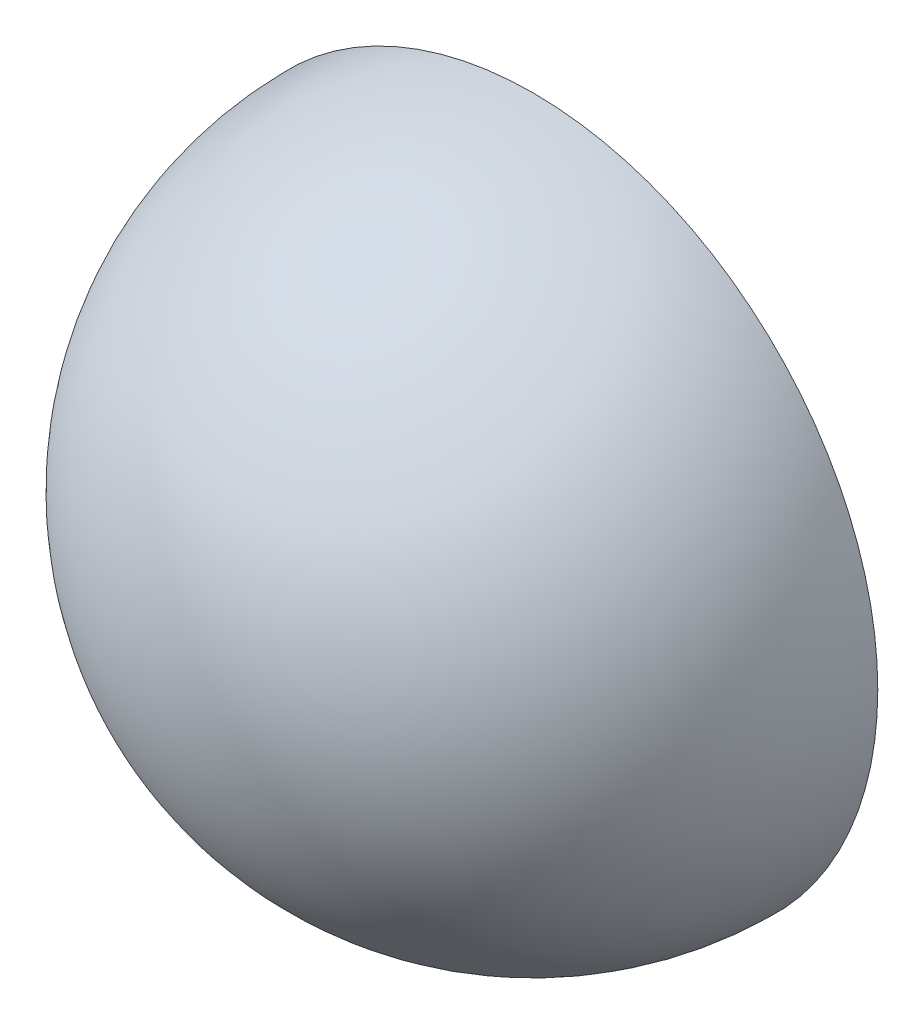
ISO-10303-21;
HEADER;
FILE_DESCRIPTION(('STEP AP214'),'2;1');
FILE_NAME('part.step','',(''),(''),'','','');
FILE_SCHEMA(('AUTOMOTIVE_DESIGN { 1 0 10303 214 1 1 1 1 }'));
ENDSEC;
DATA;
#1=APPLICATION_CONTEXT('core data for automotive mechanical design processes');
#2=APPLICATION_PROTOCOL_DEFINITION('international standard','automotive_design',2000,#1);
#3=PRODUCT_CONTEXT('',#1,'mechanical');
#4=PRODUCT('Part','Part','',(#3));
#5=PRODUCT_RELATED_PRODUCT_CATEGORY('part','',(#4));
#6=PRODUCT_DEFINITION_FORMATION('','',#4);
#7=PRODUCT_DEFINITION_CONTEXT('part definition',#1,'design');
#8=PRODUCT_DEFINITION('design','',#6,#7);
#9=PRODUCT_DEFINITION_SHAPE('','',#8);
#10=(LENGTH_UNIT() NAMED_UNIT(*) SI_UNIT(.MILLI.,.METRE.));
#11=(NAMED_UNIT(*) PLANE_ANGLE_UNIT() SI_UNIT($,.RADIAN.));
#12=(NAMED_UNIT(*) SI_UNIT($,.STERADIAN.) SOLID_ANGLE_UNIT());
#13=UNCERTAINTY_MEASURE_WITH_UNIT(LENGTH_MEASURE(1.E-05),#10,'distance_accuracy_value','');
#14=(GEOMETRIC_REPRESENTATION_CONTEXT(3) GLOBAL_UNCERTAINTY_ASSIGNED_CONTEXT((#13)) GLOBAL_UNIT_ASSIGNED_CONTEXT((#10,
#11,#12)) REPRESENTATION_CONTEXT('',''));
#15=CARTESIAN_POINT('',(0.,0.,0.));
#16=DIRECTION('',(0.,0.,1.));
#17=DIRECTION('',(1.,0.,0.));
#18=AXIS2_PLACEMENT_3D('',#15,#16,#17);
#19=CARTESIAN_POINT('',(-2.5,0.,0.));
#20=DIRECTION('',(0.,0.,1.));
#21=DIRECTION('',(1.,0.,0.));
#22=AXIS2_PLACEMENT_3D('',#19,#20,#21);
#23=PLANE('',#22);
#24=CARTESIAN_POINT('',(0.,0.,0.));
#25=DIRECTION('',(0.,0.,1.));
#26=DIRECTION('',(1.,0.,0.));
#27=AXIS2_PLACEMENT_3D('',#24,#25,#26);
#28=CIRCLE('',#27,2.5);
#29=CARTESIAN_POINT('',(2.5,0.,0.));
#30=VERTEX_POINT('',#29);
#31=EDGE_CURVE('E10',#30,#30,#28,.T.);
#32=ORIENTED_EDGE('',*,*,#31,.F.);
#33=EDGE_LOOP('',(#32));
#34=FACE_BOUND('',#33,.T.);
#35=ADVANCED_FACE('F33',(#34),#23,.F.);
#36=CARTESIAN_POINT('',(0.,0.,0.));
#37=DIRECTION('',(0.,0.,1.));
#38=DIRECTION('',(-1.,0.,0.));
#39=AXIS2_PLACEMENT_3D('',#36,#37,#38);
#40=SPHERICAL_SURFACE('',#39,2.5);
#41=ORIENTED_EDGE('',*,*,#31,.T.);
#42=EDGE_LOOP('',(#41));
#43=FACE_BOUND('',#42,.T.);
#44=ADVANCED_FACE('F40',(#43),#40,.T.);
#45=CLOSED_SHELL('',(#35,#44));
#46=MANIFOLD_SOLID_BREP('B2',#45);
#47=ADVANCED_BREP_SHAPE_REPRESENTATION('',(#18,#46),#14);
#48=SHAPE_DEFINITION_REPRESENTATION(#9,#47);
ENDSEC;
END-ISO-10303-21;
